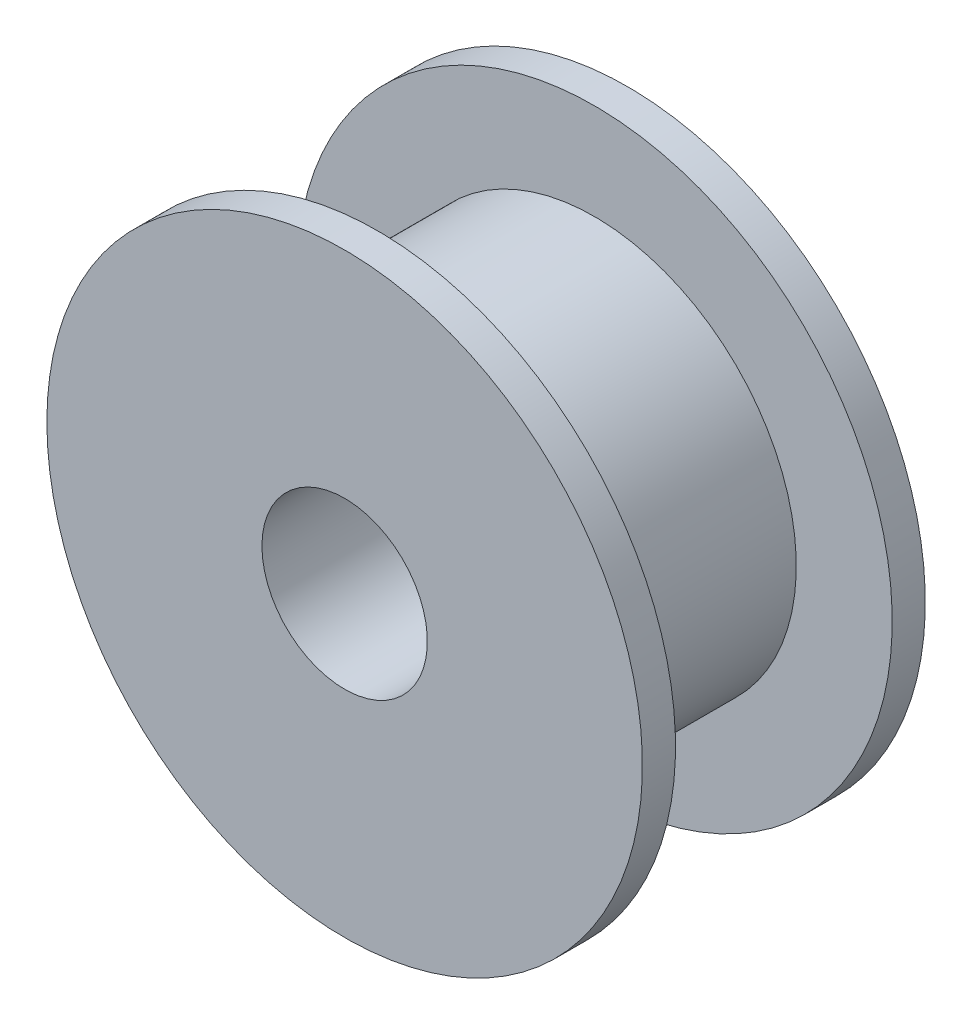
ISO-10303-21;
HEADER;
FILE_DESCRIPTION(('STEP AP214'),'2;1');
FILE_NAME('part.step','',(''),(''),'','','');
FILE_SCHEMA(('AUTOMOTIVE_DESIGN { 1 0 10303 214 1 1 1 1 }'));
ENDSEC;
DATA;
#1=APPLICATION_CONTEXT('core data for automotive mechanical design processes');
#2=APPLICATION_PROTOCOL_DEFINITION('international standard','automotive_design',2000,#1);
#3=PRODUCT_CONTEXT('',#1,'mechanical');
#4=PRODUCT('Part','Part','',(#3));
#5=PRODUCT_RELATED_PRODUCT_CATEGORY('part','',(#4));
#6=PRODUCT_DEFINITION_FORMATION('','',#4);
#7=PRODUCT_DEFINITION_CONTEXT('part definition',#1,'design');
#8=PRODUCT_DEFINITION('design','',#6,#7);
#9=PRODUCT_DEFINITION_SHAPE('','',#8);
#10=(LENGTH_UNIT() NAMED_UNIT(*) SI_UNIT(.MILLI.,.METRE.));
#11=(NAMED_UNIT(*) PLANE_ANGLE_UNIT() SI_UNIT($,.RADIAN.));
#12=(NAMED_UNIT(*) SI_UNIT($,.STERADIAN.) SOLID_ANGLE_UNIT());
#13=UNCERTAINTY_MEASURE_WITH_UNIT(LENGTH_MEASURE(1.E-05),#10,'distance_accuracy_value','');
#14=(GEOMETRIC_REPRESENTATION_CONTEXT(3) GLOBAL_UNCERTAINTY_ASSIGNED_CONTEXT((#13)) GLOBAL_UNIT_ASSIGNED_CONTEXT((#10,
#11,#12)) REPRESENTATION_CONTEXT('',''));
#15=CARTESIAN_POINT('',(0.,0.,0.));
#16=DIRECTION('',(0.,0.,1.));
#17=DIRECTION('',(1.,0.,0.));
#18=AXIS2_PLACEMENT_3D('',#15,#16,#17);
#19=CARTESIAN_POINT('',(0.,0.,-4.275));
#20=DIRECTION('',(0.,0.,-1.));
#21=DIRECTION('',(-1.,0.,0.));
#22=AXIS2_PLACEMENT_3D('',#19,#20,#21);
#23=CYLINDRICAL_SURFACE('',#22,9.);
#24=CARTESIAN_POINT('',(0.,0.,-3.275));
#25=DIRECTION('',(0.,0.,-1.));
#26=DIRECTION('',(-1.,0.,0.));
#27=AXIS2_PLACEMENT_3D('',#24,#25,#26);
#28=CIRCLE('',#27,9.);
#29=CARTESIAN_POINT('',(-9.,0.,-3.275));
#30=VERTEX_POINT('',#29);
#31=EDGE_CURVE('E69',#30,#30,#28,.T.);
#32=ORIENTED_EDGE('',*,*,#31,.T.);
#33=EDGE_LOOP('',(#32));
#34=FACE_BOUND('',#33,.T.);
#35=CARTESIAN_POINT('',(0.,0.,-4.275));
#36=DIRECTION('',(0.,0.,-1.));
#37=DIRECTION('',(-1.,0.,0.));
#38=AXIS2_PLACEMENT_3D('',#35,#36,#37);
#39=CIRCLE('',#38,9.);
#40=CARTESIAN_POINT('',(-9.,0.,-4.275));
#41=VERTEX_POINT('',#40);
#42=EDGE_CURVE('E10',#41,#41,#39,.T.);
#43=ORIENTED_EDGE('',*,*,#42,.F.);
#44=EDGE_LOOP('',(#43));
#45=FACE_BOUND('',#44,.T.);
#46=ADVANCED_FACE('F41',(#34,#45),#23,.T.);
#47=CARTESIAN_POINT('',(-9.,0.,-4.275));
#48=DIRECTION('',(0.,0.,-1.));
#49=DIRECTION('',(-1.,0.,0.));
#50=AXIS2_PLACEMENT_3D('',#47,#48,#49);
#51=PLANE('',#50);
#52=ORIENTED_EDGE('',*,*,#42,.T.);
#53=EDGE_LOOP('',(#52));
#54=FACE_BOUND('',#53,.T.);
#55=CARTESIAN_POINT('',(0.,0.,-4.275));
#56=DIRECTION('',(0.,0.,-1.));
#57=DIRECTION('',(-1.,0.,0.));
#58=AXIS2_PLACEMENT_3D('',#55,#56,#57);
#59=CIRCLE('',#58,2.5);
#60=CARTESIAN_POINT('',(-2.5,0.,-4.275));
#61=VERTEX_POINT('',#60);
#62=EDGE_CURVE('E47',#61,#61,#59,.T.);
#63=ORIENTED_EDGE('',*,*,#62,.F.);
#64=EDGE_LOOP('',(#63));
#65=FACE_BOUND('',#64,.T.);
#66=ADVANCED_FACE('F87',(#54,#65),#51,.T.);
#67=CARTESIAN_POINT('',(0.,0.,-4.275));
#68=DIRECTION('',(0.,0.,-1.));
#69=DIRECTION('',(-1.,0.,0.));
#70=AXIS2_PLACEMENT_3D('',#67,#68,#69);
#71=CYLINDRICAL_SURFACE('',#70,2.5);
#72=ORIENTED_EDGE('',*,*,#62,.T.);
#73=EDGE_LOOP('',(#72));
#74=FACE_BOUND('',#73,.T.);
#75=CARTESIAN_POINT('',(0.,0.,4.275));
#76=DIRECTION('',(0.,0.,-1.));
#77=DIRECTION('',(-1.,0.,0.));
#78=AXIS2_PLACEMENT_3D('',#75,#76,#77);
#79=CIRCLE('',#78,2.5);
#80=CARTESIAN_POINT('',(-2.5,0.,4.275));
#81=VERTEX_POINT('',#80);
#82=EDGE_CURVE('E51',#81,#81,#79,.T.);
#83=ORIENTED_EDGE('',*,*,#82,.F.);
#84=EDGE_LOOP('',(#83));
#85=FACE_BOUND('',#84,.T.);
#86=ADVANCED_FACE('F91',(#74,#85),#71,.F.);
#87=CARTESIAN_POINT('',(-2.5,0.,4.275));
#88=DIRECTION('',(0.,0.,1.));
#89=DIRECTION('',(1.,0.,0.));
#90=AXIS2_PLACEMENT_3D('',#87,#88,#89);
#91=PLANE('',#90);
#92=ORIENTED_EDGE('',*,*,#82,.T.);
#93=EDGE_LOOP('',(#92));
#94=FACE_BOUND('',#93,.T.);
#95=CARTESIAN_POINT('',(0.,0.,4.275));
#96=DIRECTION('',(0.,0.,-1.));
#97=DIRECTION('',(-1.,0.,0.));
#98=AXIS2_PLACEMENT_3D('',#95,#96,#97);
#99=CIRCLE('',#98,9.);
#100=CARTESIAN_POINT('',(-9.,0.,4.275));
#101=VERTEX_POINT('',#100);
#102=EDGE_CURVE('E55',#101,#101,#99,.T.);
#103=ORIENTED_EDGE('',*,*,#102,.F.);
#104=EDGE_LOOP('',(#103));
#105=FACE_BOUND('',#104,.T.);
#106=ADVANCED_FACE('F95',(#94,#105),#91,.T.);
#107=CARTESIAN_POINT('',(0.,0.,-4.275));
#108=DIRECTION('',(0.,0.,-1.));
#109=DIRECTION('',(-1.,0.,0.));
#110=AXIS2_PLACEMENT_3D('',#107,#108,#109);
#111=CYLINDRICAL_SURFACE('',#110,9.);
#112=ORIENTED_EDGE('',*,*,#102,.T.);
#113=EDGE_LOOP('',(#112));
#114=FACE_BOUND('',#113,.T.);
#115=CARTESIAN_POINT('',(0.,0.,3.275));
#116=DIRECTION('',(0.,0.,-1.));
#117=DIRECTION('',(-1.,0.,0.));
#118=AXIS2_PLACEMENT_3D('',#115,#116,#117);
#119=CIRCLE('',#118,9.);
#120=CARTESIAN_POINT('',(-9.,0.,3.275));
#121=VERTEX_POINT('',#120);
#122=EDGE_CURVE('E60',#121,#121,#119,.T.);
#123=ORIENTED_EDGE('',*,*,#122,.F.);
#124=EDGE_LOOP('',(#123));
#125=FACE_BOUND('',#124,.T.);
#126=ADVANCED_FACE('F101',(#114,#125),#111,.T.);
#127=CARTESIAN_POINT('',(-9.,0.,3.275));
#128=DIRECTION('',(0.,0.,-1.));
#129=DIRECTION('',(-1.,0.,0.));
#130=AXIS2_PLACEMENT_3D('',#127,#128,#129);
#131=PLANE('',#130);
#132=ORIENTED_EDGE('',*,*,#122,.T.);
#133=EDGE_LOOP('',(#132));
#134=FACE_BOUND('',#133,.T.);
#135=CARTESIAN_POINT('',(0.,0.,3.275));
#136=DIRECTION('',(0.,0.,-1.));
#137=DIRECTION('',(-1.,0.,0.));
#138=AXIS2_PLACEMENT_3D('',#135,#136,#137);
#139=CIRCLE('',#138,6.1);
#140=CARTESIAN_POINT('',(-6.1,0.,3.275));
#141=VERTEX_POINT('',#140);
#142=EDGE_CURVE('E63',#141,#141,#139,.T.);
#143=ORIENTED_EDGE('',*,*,#142,.F.);
#144=EDGE_LOOP('',(#143));
#145=FACE_BOUND('',#144,.T.);
#146=ADVANCED_FACE('F83',(#134,#145),#131,.T.);
#147=CARTESIAN_POINT('',(0.,0.,-4.275));
#148=DIRECTION('',(0.,0.,-1.));
#149=DIRECTION('',(-1.,0.,0.));
#150=AXIS2_PLACEMENT_3D('',#147,#148,#149);
#151=CYLINDRICAL_SURFACE('',#150,6.1);
#152=ORIENTED_EDGE('',*,*,#142,.T.);
#153=EDGE_LOOP('',(#152));
#154=FACE_BOUND('',#153,.T.);
#155=CARTESIAN_POINT('',(0.,0.,-3.275));
#156=DIRECTION('',(0.,0.,-1.));
#157=DIRECTION('',(-1.,0.,0.));
#158=AXIS2_PLACEMENT_3D('',#155,#156,#157);
#159=CIRCLE('',#158,6.1);
#160=CARTESIAN_POINT('',(-6.1,0.,-3.275));
#161=VERTEX_POINT('',#160);
#162=EDGE_CURVE('E66',#161,#161,#159,.T.);
#163=ORIENTED_EDGE('',*,*,#162,.F.);
#164=EDGE_LOOP('',(#163));
#165=FACE_BOUND('',#164,.T.);
#166=ADVANCED_FACE('F77',(#154,#165),#151,.T.);
#167=CARTESIAN_POINT('',(-6.1,0.,-3.275));
#168=DIRECTION('',(0.,0.,1.));
#169=DIRECTION('',(1.,0.,0.));
#170=AXIS2_PLACEMENT_3D('',#167,#168,#169);
#171=PLANE('',#170);
#172=ORIENTED_EDGE('',*,*,#162,.T.);
#173=EDGE_LOOP('',(#172));
#174=FACE_BOUND('',#173,.T.);
#175=ORIENTED_EDGE('',*,*,#31,.F.);
#176=EDGE_LOOP('',(#175));
#177=FACE_BOUND('',#176,.T.);
#178=ADVANCED_FACE('F75',(#174,#177),#171,.T.);
#179=CLOSED_SHELL('',(#46,#66,#86,#106,#126,#146,#166,#178));
#180=MANIFOLD_SOLID_BREP('B2',#179);
#181=ADVANCED_BREP_SHAPE_REPRESENTATION('',(#18,#180),#14);
#182=SHAPE_DEFINITION_REPRESENTATION(#9,#181);
ENDSEC;
END-ISO-10303-21;
